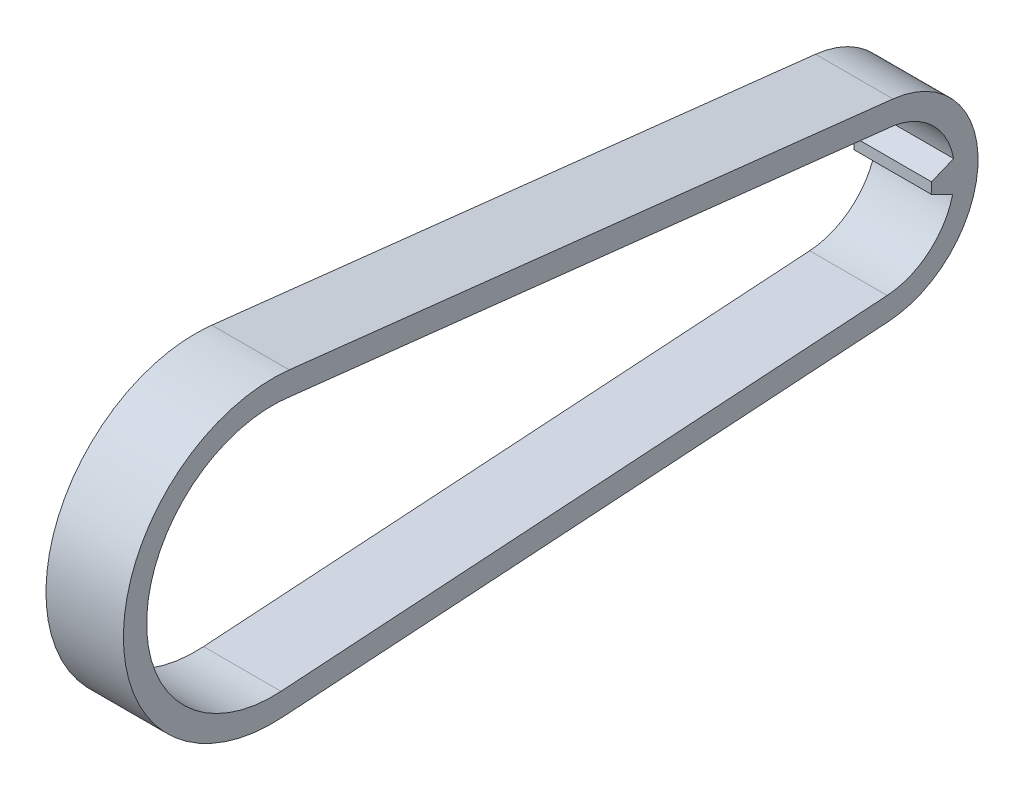
ISO-10303-21;
HEADER;
FILE_DESCRIPTION(('STEP AP214'),'2;1');
FILE_NAME('part.step','',(''),(''),'','','');
FILE_SCHEMA(('AUTOMOTIVE_DESIGN { 1 0 10303 214 1 1 1 1 }'));
ENDSEC;
DATA;
#1=APPLICATION_CONTEXT('core data for automotive mechanical design processes');
#2=APPLICATION_PROTOCOL_DEFINITION('international standard','automotive_design',2000,#1);
#3=PRODUCT_CONTEXT('',#1,'mechanical');
#4=PRODUCT('Part','Part','',(#3));
#5=PRODUCT_RELATED_PRODUCT_CATEGORY('part','',(#4));
#6=PRODUCT_DEFINITION_FORMATION('','',#4);
#7=PRODUCT_DEFINITION_CONTEXT('part definition',#1,'design');
#8=PRODUCT_DEFINITION('design','',#6,#7);
#9=PRODUCT_DEFINITION_SHAPE('','',#8);
#10=(LENGTH_UNIT() NAMED_UNIT(*) SI_UNIT(.MILLI.,.METRE.));
#11=(NAMED_UNIT(*) PLANE_ANGLE_UNIT() SI_UNIT($,.RADIAN.));
#12=(NAMED_UNIT(*) SI_UNIT($,.STERADIAN.) SOLID_ANGLE_UNIT());
#13=UNCERTAINTY_MEASURE_WITH_UNIT(LENGTH_MEASURE(1.E-05),#10,'distance_accuracy_value','');
#14=(GEOMETRIC_REPRESENTATION_CONTEXT(3) GLOBAL_UNCERTAINTY_ASSIGNED_CONTEXT((#13)) GLOBAL_UNIT_ASSIGNED_CONTEXT((#10,
#11,#12)) REPRESENTATION_CONTEXT('',''));
#15=CARTESIAN_POINT('',(0.,0.,0.));
#16=DIRECTION('',(0.,0.,1.));
#17=DIRECTION('',(1.,0.,0.));
#18=AXIS2_PLACEMENT_3D('',#15,#16,#17);
#19=CARTESIAN_POINT('',(10.,0.,0.));
#20=DIRECTION('',(-1.,0.,0.));
#21=DIRECTION('',(0.,0.,1.));
#22=AXIS2_PLACEMENT_3D('',#19,#20,#21);
#23=CYLINDRICAL_SURFACE('',#22,9.34893538375021);
#24=DIRECTION('',(-1.,0.,0.));
#25=VECTOR('',#24,1.);
#26=CARTESIAN_POINT('',(10.,-2.27050491439108,-9.06903524321419));
#27=LINE('',#26,#25);
#28=CARTESIAN_POINT('',(10.,-2.27050491439108,-9.06903524321419));
#29=VERTEX_POINT('',#28);
#30=CARTESIAN_POINT('',(0.,-2.27050491439108,-9.06903524321419));
#31=VERTEX_POINT('',#30);
#32=EDGE_CURVE('E170',#29,#31,#27,.T.);
#33=ORIENTED_EDGE('',*,*,#32,.T.);
#34=CARTESIAN_POINT('',(0.,0.,0.));
#35=DIRECTION('',(1.,0.,0.));
#36=DIRECTION('',(0.,0.,-1.));
#37=AXIS2_PLACEMENT_3D('',#34,#35,#36);
#38=CIRCLE('',#37,9.34893538375021);
#39=CARTESIAN_POINT('',(0.,-9.32893992311466,-0.611124143894561));
#40=VERTEX_POINT('',#39);
#41=EDGE_CURVE('E199',#40,#31,#38,.T.);
#42=ORIENTED_EDGE('',*,*,#41,.F.);
#43=DIRECTION('',(-1.,0.,0.));
#44=VECTOR('',#43,1.);
#45=CARTESIAN_POINT('',(10.,-9.32893992311466,-0.611124143894561));
#46=LINE('',#45,#44);
#47=CARTESIAN_POINT('',(10.,-9.32893992311466,-0.611124143894561));
#48=VERTEX_POINT('',#47);
#49=EDGE_CURVE('E212',#48,#40,#46,.T.);
#50=ORIENTED_EDGE('',*,*,#49,.F.);
#51=CARTESIAN_POINT('',(10.,0.,0.));
#52=DIRECTION('',(1.,0.,0.));
#53=DIRECTION('',(0.,0.,-1.));
#54=AXIS2_PLACEMENT_3D('',#51,#52,#53);
#55=CIRCLE('',#54,9.34893538375021);
#56=EDGE_CURVE('E183',#48,#29,#55,.T.);
#57=ORIENTED_EDGE('',*,*,#56,.T.);
#58=EDGE_LOOP('',(#33,#42,#50,#57));
#59=FACE_BOUND('',#58,.T.);
#60=ADVANCED_FACE('F39',(#59),#23,.F.);
#61=CARTESIAN_POINT('',(10.,0.,0.));
#62=DIRECTION('',(1.,0.,0.));
#63=DIRECTION('',(0.,0.,-1.));
#64=AXIS2_PLACEMENT_3D('',#61,#62,#63);
#65=PLANE('',#64);
#66=CARTESIAN_POINT('',(10.,0.,0.));
#67=DIRECTION('',(1.,0.,0.));
#68=DIRECTION('',(0.,0.,-1.));
#69=AXIS2_PLACEMENT_3D('',#66,#67,#68);
#70=CIRCLE('',#69,12.3489353839288);
#71=CARTESIAN_POINT('',(10.,-12.3225235369909,-0.807229085672322));
#72=VERTEX_POINT('',#71);
#73=CARTESIAN_POINT('',(10.,12.2730966481305,-1.36649324260929));
#74=VERTEX_POINT('',#73);
#75=EDGE_CURVE('E220',#72,#74,#70,.T.);
#76=ORIENTED_EDGE('',*,*,#75,.T.);
#77=DIRECTION('',(0.,0.110656765148166,0.993858682271752));
#78=VECTOR('',#77,1.);
#79=CARTESIAN_POINT('',(10.,20.953089015316,76.5924617713833));
#80=LINE('',#79,#78);
#81=CARTESIAN_POINT('',(10.,20.953089015316,76.5924617713833));
#82=VERTEX_POINT('',#81);
#83=EDGE_CURVE('E224',#74,#82,#80,.T.);
#84=ORIENTED_EDGE('',*,*,#83,.T.);
#85=CARTESIAN_POINT('',(10.,1.79010221894155,78.7260791229133));
#86=DIRECTION('',(1.,0.,0.));
#87=DIRECTION('',(0.,0.,-1.));
#88=AXIS2_PLACEMENT_3D('',#85,#86,#87);
#89=CIRCLE('',#88,19.28140000002);
#90=CARTESIAN_POINT('',(10.,-17.4500588102913,77.4656865134618));
#91=VERTEX_POINT('',#90);
#92=EDGE_CURVE('E228',#82,#91,#89,.T.);
#93=ORIENTED_EDGE('',*,*,#92,.T.);
#94=DIRECTION('',(0.,0.0653683139943276,-0.997861204539759));
#95=VECTOR('',#94,1.);
#96=CARTESIAN_POINT('',(10.,-17.4500588102913,77.4656865134618));
#97=LINE('',#96,#95);
#98=EDGE_CURVE('E231',#91,#72,#97,.T.);
#99=ORIENTED_EDGE('',*,*,#98,.T.);
#100=EDGE_LOOP('',(#76,#84,#93,#99));
#101=FACE_BOUND('',#100,.T.);
#102=DIRECTION('',(0.,0.0653683139972204,-0.99786120453957));
#103=VECTOR('',#102,1.);
#104=CARTESIAN_POINT('',(10.,-14.4564751966547,77.6617914554182));
#105=LINE('',#104,#103);
#106=CARTESIAN_POINT('',(10.,-14.4564751966547,77.6617914554182));
#107=VERTEX_POINT('',#106);
#108=EDGE_CURVE('E179',#107,#48,#105,.T.);
#109=ORIENTED_EDGE('',*,*,#108,.F.);
#110=CARTESIAN_POINT('',(10.,1.79010221894155,78.7260791229133));
#111=DIRECTION('',(1.,0.,0.));
#112=DIRECTION('',(0.,0.,-1.));
#113=AXIS2_PLACEMENT_3D('',#110,#111,#112);
#114=CIRCLE('',#113,16.2813999999979);
#115=CARTESIAN_POINT('',(10.,17.8769256292993,76.2164778550451));
#116=VERTEX_POINT('',#115);
#117=EDGE_CURVE('E176',#116,#107,#114,.T.);
#118=ORIENTED_EDGE('',*,*,#117,.F.);
#119=DIRECTION('',(0.,0.110571917351726,0.993868125604782));
#120=VECTOR('',#119,1.);
#121=CARTESIAN_POINT('',(10.,17.8769256292993,76.2164778550451));
#122=LINE('',#121,#120);
#123=CARTESIAN_POINT('',(10.,9.23720764758625,-1.44103701760436));
#124=VERTEX_POINT('',#123);
#125=EDGE_CURVE('E187',#124,#116,#122,.T.);
#126=ORIENTED_EDGE('',*,*,#125,.F.);
#127=CARTESIAN_POINT('',(10.,1.68716786081824,-9.19543677148384));
#128=VERTEX_POINT('',#127);
#129=EDGE_CURVE('E63',#128,#124,#55,.T.);
#130=ORIENTED_EDGE('',*,*,#129,.F.);
#131=DIRECTION('',(0.,0.378390868507328,-0.925645909962481));
#132=VECTOR('',#131,1.);
#133=CARTESIAN_POINT('',(10.,0.518546586994935,-6.33667459607277));
#134=LINE('',#133,#132);
#135=CARTESIAN_POINT('',(10.,0.518546586994935,-6.33667459607277));
#136=VERTEX_POINT('',#135);
#137=EDGE_CURVE('E133',#136,#128,#134,.T.);
#138=ORIENTED_EDGE('',*,*,#137,.F.);
#139=DIRECTION('',(0.,0.999630970666581,-0.0271647286787288));
#140=VECTOR('',#139,1.);
#141=CARTESIAN_POINT('',(10.,0.518546586994935,-6.33667459607277));
#142=LINE('',#141,#140);
#143=CARTESIAN_POINT('',(10.,-0.861922339698237,-6.29916068849742));
#144=VERTEX_POINT('',#143);
#145=EDGE_CURVE('E146',#144,#136,#142,.T.);
#146=ORIENTED_EDGE('',*,*,#145,.F.);
#147=DIRECTION('',(0.,0.453290600473551,0.891362794558045));
#148=VECTOR('',#147,1.);
#149=CARTESIAN_POINT('',(10.,-0.861922339698237,-6.29916068849742));
#150=LINE('',#149,#148);
#151=EDGE_CURVE('E139',#29,#144,#150,.T.);
#152=ORIENTED_EDGE('',*,*,#151,.F.);
#153=ORIENTED_EDGE('',*,*,#56,.F.);
#154=EDGE_LOOP('',(#109,#118,#126,#130,#138,#146,#152,#153));
#155=FACE_BOUND('',#154,.T.);
#156=ADVANCED_FACE('F144',(#101,#155),#65,.T.);
#157=CARTESIAN_POINT('',(0.,0.,0.));
#158=DIRECTION('',(1.,0.,0.));
#159=DIRECTION('',(0.,0.,-1.));
#160=AXIS2_PLACEMENT_3D('',#157,#158,#159);
#161=PLANE('',#160);
#162=CARTESIAN_POINT('',(0.,0.,0.));
#163=DIRECTION('',(1.,0.,0.));
#164=DIRECTION('',(0.,0.,-1.));
#165=AXIS2_PLACEMENT_3D('',#162,#163,#164);
#166=CIRCLE('',#165,12.3489353839288);
#167=CARTESIAN_POINT('',(0.,-12.3225235369909,-0.807229085672322));
#168=VERTEX_POINT('',#167);
#169=CARTESIAN_POINT('',(0.,12.2730966481305,-1.36649324260929));
#170=VERTEX_POINT('',#169);
#171=EDGE_CURVE('E219',#168,#170,#166,.T.);
#172=ORIENTED_EDGE('',*,*,#171,.F.);
#173=DIRECTION('',(0.,0.0653683139943276,-0.997861204539759));
#174=VECTOR('',#173,1.);
#175=CARTESIAN_POINT('',(0.,-17.4500588102913,77.4656865134618));
#176=LINE('',#175,#174);
#177=CARTESIAN_POINT('',(0.,-17.4500588102913,77.4656865134618));
#178=VERTEX_POINT('',#177);
#179=EDGE_CURVE('E225',#178,#168,#176,.T.);
#180=ORIENTED_EDGE('',*,*,#179,.F.);
#181=CARTESIAN_POINT('',(0.,1.79010221894155,78.7260791229133));
#182=DIRECTION('',(1.,0.,0.));
#183=DIRECTION('',(0.,0.,-1.));
#184=AXIS2_PLACEMENT_3D('',#181,#182,#183);
#185=CIRCLE('',#184,19.28140000002);
#186=CARTESIAN_POINT('',(0.,20.953089015316,76.5924617713833));
#187=VERTEX_POINT('',#186);
#188=EDGE_CURVE('E241',#187,#178,#185,.T.);
#189=ORIENTED_EDGE('',*,*,#188,.F.);
#190=DIRECTION('',(0.,0.110656765148166,0.993858682271752));
#191=VECTOR('',#190,1.);
#192=CARTESIAN_POINT('',(0.,20.953089015316,76.5924617713833));
#193=LINE('',#192,#191);
#194=EDGE_CURVE('E238',#170,#187,#193,.T.);
#195=ORIENTED_EDGE('',*,*,#194,.F.);
#196=EDGE_LOOP('',(#172,#180,#189,#195));
#197=FACE_BOUND('',#196,.T.);
#198=CARTESIAN_POINT('',(0.,1.79010221894155,78.7260791229133));
#199=DIRECTION('',(1.,0.,0.));
#200=DIRECTION('',(0.,0.,-1.));
#201=AXIS2_PLACEMENT_3D('',#198,#199,#200);
#202=CIRCLE('',#201,16.2813999999979);
#203=CARTESIAN_POINT('',(0.,17.8769256292993,76.2164778550451));
#204=VERTEX_POINT('',#203);
#205=CARTESIAN_POINT('',(0.,-14.4564751966547,77.6617914554182));
#206=VERTEX_POINT('',#205);
#207=EDGE_CURVE('E169',#204,#206,#202,.T.);
#208=ORIENTED_EDGE('',*,*,#207,.T.);
#209=DIRECTION('',(0.,0.0653683139972204,-0.99786120453957));
#210=VECTOR('',#209,1.);
#211=CARTESIAN_POINT('',(0.,-14.4564751966547,77.6617914554182));
#212=LINE('',#211,#210);
#213=EDGE_CURVE('E194',#206,#40,#212,.T.);
#214=ORIENTED_EDGE('',*,*,#213,.T.);
#215=ORIENTED_EDGE('',*,*,#41,.T.);
#216=DIRECTION('',(0.,0.453290600473551,0.891362794558045));
#217=VECTOR('',#216,1.);
#218=CARTESIAN_POINT('',(0.,-0.861922339698237,-6.29916068849742));
#219=LINE('',#218,#217);
#220=CARTESIAN_POINT('',(0.,-0.861922339698237,-6.29916068849742));
#221=VERTEX_POINT('',#220);
#222=EDGE_CURVE('E154',#31,#221,#219,.T.);
#223=ORIENTED_EDGE('',*,*,#222,.T.);
#224=DIRECTION('',(0.,0.999630970666581,-0.0271647286787288));
#225=VECTOR('',#224,1.);
#226=CARTESIAN_POINT('',(0.,0.518546586994935,-6.33667459607277));
#227=LINE('',#226,#225);
#228=CARTESIAN_POINT('',(0.,0.518546586994935,-6.33667459607277));
#229=VERTEX_POINT('',#228);
#230=EDGE_CURVE('E162',#221,#229,#227,.T.);
#231=ORIENTED_EDGE('',*,*,#230,.T.);
#232=DIRECTION('',(0.,0.378390868507328,-0.925645909962481));
#233=VECTOR('',#232,1.);
#234=CARTESIAN_POINT('',(0.,0.518546586994935,-6.33667459607277));
#235=LINE('',#234,#233);
#236=CARTESIAN_POINT('',(0.,1.68716786083069,-9.19543677151427));
#237=VERTEX_POINT('',#236);
#238=EDGE_CURVE('E55',#229,#237,#235,.T.);
#239=ORIENTED_EDGE('',*,*,#238,.T.);
#240=CARTESIAN_POINT('',(0.,9.23720764752156,-1.44103701760436));
#241=VERTEX_POINT('',#240);
#242=EDGE_CURVE('E198',#237,#241,#38,.T.);
#243=ORIENTED_EDGE('',*,*,#242,.T.);
#244=DIRECTION('',(0.,0.110571917351726,0.993868125604782));
#245=VECTOR('',#244,1.);
#246=CARTESIAN_POINT('',(0.,17.8769256292993,76.2164778550451));
#247=LINE('',#246,#245);
#248=EDGE_CURVE('E180',#241,#204,#247,.T.);
#249=ORIENTED_EDGE('',*,*,#248,.T.);
#250=EDGE_LOOP('',(#208,#214,#215,#223,#231,#239,#243,#249));
#251=FACE_BOUND('',#250,.T.);
#252=ADVANCED_FACE('F264',(#197,#251),#161,.F.);
#253=CARTESIAN_POINT('',(10.,0.,0.));
#254=DIRECTION('',(-1.,0.,0.));
#255=DIRECTION('',(0.,0.,1.));
#256=AXIS2_PLACEMENT_3D('',#253,#254,#255);
#257=CYLINDRICAL_SURFACE('',#256,12.3489353839288);
#258=ORIENTED_EDGE('',*,*,#171,.T.);
#259=DIRECTION('',(-1.,0.,0.));
#260=VECTOR('',#259,1.);
#261=CARTESIAN_POINT('',(10.,12.2730966481305,-1.36649324260929));
#262=LINE('',#261,#260);
#263=EDGE_CURVE('E11',#74,#170,#262,.T.);
#264=ORIENTED_EDGE('',*,*,#263,.F.);
#265=ORIENTED_EDGE('',*,*,#75,.F.);
#266=DIRECTION('',(-1.,0.,0.));
#267=VECTOR('',#266,1.);
#268=CARTESIAN_POINT('',(10.,-12.3225235369909,-0.807229085672322));
#269=LINE('',#268,#267);
#270=EDGE_CURVE('E234',#72,#168,#269,.T.);
#271=ORIENTED_EDGE('',*,*,#270,.T.);
#272=EDGE_LOOP('',(#258,#264,#265,#271));
#273=FACE_BOUND('',#272,.T.);
#274=ADVANCED_FACE('F41',(#273),#257,.T.);
#275=CARTESIAN_POINT('',(10.,20.953089015316,76.5924617713833));
#276=DIRECTION('',(0.,-0.993858682271752,0.110656765148166));
#277=DIRECTION('',(0.,-0.110656765148166,-0.993858682271752));
#278=AXIS2_PLACEMENT_3D('',#275,#276,#277);
#279=PLANE('',#278);
#280=ORIENTED_EDGE('',*,*,#194,.T.);
#281=DIRECTION('',(-1.,0.,0.));
#282=VECTOR('',#281,1.);
#283=CARTESIAN_POINT('',(10.,20.953089015316,76.5924617713833));
#284=LINE('',#283,#282);
#285=EDGE_CURVE('E48',#82,#187,#284,.T.);
#286=ORIENTED_EDGE('',*,*,#285,.F.);
#287=ORIENTED_EDGE('',*,*,#83,.F.);
#288=ORIENTED_EDGE('',*,*,#263,.T.);
#289=EDGE_LOOP('',(#280,#286,#287,#288));
#290=FACE_BOUND('',#289,.T.);
#291=ADVANCED_FACE('F273',(#290),#279,.F.);
#292=CARTESIAN_POINT('',(10.,1.79010221894155,78.7260791229133));
#293=DIRECTION('',(-1.,0.,0.));
#294=DIRECTION('',(0.,0.,1.));
#295=AXIS2_PLACEMENT_3D('',#292,#293,#294);
#296=CYLINDRICAL_SURFACE('',#295,19.28140000002);
#297=ORIENTED_EDGE('',*,*,#188,.T.);
#298=DIRECTION('',(-1.,0.,0.));
#299=VECTOR('',#298,1.);
#300=CARTESIAN_POINT('',(10.,-17.4500588102913,77.4656865134618));
#301=LINE('',#300,#299);
#302=EDGE_CURVE('E249',#91,#178,#301,.T.);
#303=ORIENTED_EDGE('',*,*,#302,.F.);
#304=ORIENTED_EDGE('',*,*,#92,.F.);
#305=ORIENTED_EDGE('',*,*,#285,.T.);
#306=EDGE_LOOP('',(#297,#303,#304,#305));
#307=FACE_BOUND('',#306,.T.);
#308=ADVANCED_FACE('F258',(#307),#296,.T.);
#309=CARTESIAN_POINT('',(10.,-17.4500588102913,77.4656865134618));
#310=DIRECTION('',(0.,0.997861204539759,0.0653683139943276));
#311=DIRECTION('',(0.,-0.0653683139943276,0.997861204539759));
#312=AXIS2_PLACEMENT_3D('',#309,#310,#311);
#313=PLANE('',#312);
#314=ORIENTED_EDGE('',*,*,#179,.T.);
#315=ORIENTED_EDGE('',*,*,#270,.F.);
#316=ORIENTED_EDGE('',*,*,#98,.F.);
#317=ORIENTED_EDGE('',*,*,#302,.T.);
#318=EDGE_LOOP('',(#314,#315,#316,#317));
#319=FACE_BOUND('',#318,.T.);
#320=ADVANCED_FACE('F267',(#319),#313,.F.);
#321=CARTESIAN_POINT('',(10.,1.79010221894155,78.7260791229133));
#322=DIRECTION('',(-1.,0.,0.));
#323=DIRECTION('',(0.,0.,1.));
#324=AXIS2_PLACEMENT_3D('',#321,#322,#323);
#325=CYLINDRICAL_SURFACE('',#324,16.2813999999979);
#326=ORIENTED_EDGE('',*,*,#207,.F.);
#327=DIRECTION('',(-1.,0.,0.));
#328=VECTOR('',#327,1.);
#329=CARTESIAN_POINT('',(10.,17.8769256292993,76.2164778550451));
#330=LINE('',#329,#328);
#331=EDGE_CURVE('E190',#116,#204,#330,.T.);
#332=ORIENTED_EDGE('',*,*,#331,.F.);
#333=ORIENTED_EDGE('',*,*,#117,.T.);
#334=DIRECTION('',(-1.,0.,0.));
#335=VECTOR('',#334,1.);
#336=CARTESIAN_POINT('',(10.,-14.4564751966547,77.6617914554182));
#337=LINE('',#336,#335);
#338=EDGE_CURVE('E215',#107,#206,#337,.T.);
#339=ORIENTED_EDGE('',*,*,#338,.T.);
#340=EDGE_LOOP('',(#326,#332,#333,#339));
#341=FACE_BOUND('',#340,.T.);
#342=ADVANCED_FACE('F298',(#341),#325,.F.);
#343=CARTESIAN_POINT('',(10.,-14.4564751966547,77.6617914554182));
#344=DIRECTION('',(0.,0.99786120453957,0.0653683139972204));
#345=DIRECTION('',(0.,-0.0653683139972204,0.99786120453957));
#346=AXIS2_PLACEMENT_3D('',#343,#344,#345);
#347=PLANE('',#346);
#348=ORIENTED_EDGE('',*,*,#213,.F.);
#349=ORIENTED_EDGE('',*,*,#338,.F.);
#350=ORIENTED_EDGE('',*,*,#108,.T.);
#351=ORIENTED_EDGE('',*,*,#49,.T.);
#352=EDGE_LOOP('',(#348,#349,#350,#351));
#353=FACE_BOUND('',#352,.T.);
#354=ADVANCED_FACE('F292',(#353),#347,.T.);
#355=DIRECTION('',(-1.,0.,0.));
#356=VECTOR('',#355,1.);
#357=CARTESIAN_POINT('',(10.,1.68716786081824,-9.19543677148384));
#358=LINE('',#357,#356);
#359=EDGE_CURVE('E138',#128,#237,#358,.T.);
#360=ORIENTED_EDGE('',*,*,#359,.F.);
#361=ORIENTED_EDGE('',*,*,#129,.T.);
#362=DIRECTION('',(-1.,0.,0.));
#363=VECTOR('',#362,1.);
#364=CARTESIAN_POINT('',(10.,9.23720764752156,-1.44103701760436));
#365=LINE('',#364,#363);
#366=EDGE_CURVE('E209',#124,#241,#365,.T.);
#367=ORIENTED_EDGE('',*,*,#366,.T.);
#368=ORIENTED_EDGE('',*,*,#242,.F.);
#369=EDGE_LOOP('',(#360,#361,#367,#368));
#370=FACE_BOUND('',#369,.T.);
#371=ADVANCED_FACE('F283',(#370),#23,.F.);
#372=CARTESIAN_POINT('',(10.,17.8769256292993,76.2164778550451));
#373=DIRECTION('',(0.,-0.993868125604782,0.110571917351726));
#374=DIRECTION('',(0.,-0.110571917351726,-0.993868125604782));
#375=AXIS2_PLACEMENT_3D('',#372,#373,#374);
#376=PLANE('',#375);
#377=ORIENTED_EDGE('',*,*,#248,.F.);
#378=ORIENTED_EDGE('',*,*,#366,.F.);
#379=ORIENTED_EDGE('',*,*,#125,.T.);
#380=ORIENTED_EDGE('',*,*,#331,.T.);
#381=EDGE_LOOP('',(#377,#378,#379,#380));
#382=FACE_BOUND('',#381,.T.);
#383=ADVANCED_FACE('F291',(#382),#376,.T.);
#384=CARTESIAN_POINT('',(10.,0.518546586994935,-6.33667459607277));
#385=DIRECTION('',(0.,0.0271647286787288,0.999630970666581));
#386=DIRECTION('',(0.,-0.999630970666581,0.0271647286787288));
#387=AXIS2_PLACEMENT_3D('',#384,#385,#386);
#388=PLANE('',#387);
#389=ORIENTED_EDGE('',*,*,#230,.F.);
#390=DIRECTION('',(-1.,0.,0.));
#391=VECTOR('',#390,1.);
#392=CARTESIAN_POINT('',(10.,-0.861922339698237,-6.29916068849742));
#393=LINE('',#392,#391);
#394=EDGE_CURVE('E152',#144,#221,#393,.T.);
#395=ORIENTED_EDGE('',*,*,#394,.F.);
#396=ORIENTED_EDGE('',*,*,#145,.T.);
#397=DIRECTION('',(-1.,0.,0.));
#398=VECTOR('',#397,1.);
#399=CARTESIAN_POINT('',(10.,0.518546586994935,-6.33667459607277));
#400=LINE('',#399,#398);
#401=EDGE_CURVE('E130',#136,#229,#400,.T.);
#402=ORIENTED_EDGE('',*,*,#401,.T.);
#403=EDGE_LOOP('',(#389,#395,#396,#402));
#404=FACE_BOUND('',#403,.T.);
#405=ADVANCED_FACE('F151',(#404),#388,.T.);
#406=CARTESIAN_POINT('',(10.,-0.861922339698237,-6.29916068849742));
#407=DIRECTION('',(0.,-0.891362794558045,0.453290600473551));
#408=DIRECTION('',(0.,-0.453290600473551,-0.891362794558045));
#409=AXIS2_PLACEMENT_3D('',#406,#407,#408);
#410=PLANE('',#409);
#411=ORIENTED_EDGE('',*,*,#222,.F.);
#412=ORIENTED_EDGE('',*,*,#32,.F.);
#413=ORIENTED_EDGE('',*,*,#151,.T.);
#414=ORIENTED_EDGE('',*,*,#394,.T.);
#415=EDGE_LOOP('',(#411,#412,#413,#414));
#416=FACE_BOUND('',#415,.T.);
#417=ADVANCED_FACE('F312',(#416),#410,.T.);
#418=CARTESIAN_POINT('',(10.,0.518546586994935,-6.33667459607277));
#419=DIRECTION('',(0.,0.925645909962482,0.378390868507328));
#420=DIRECTION('',(0.,-0.378390868507328,0.925645909962482));
#421=AXIS2_PLACEMENT_3D('',#418,#419,#420);
#422=PLANE('',#421);
#423=ORIENTED_EDGE('',*,*,#238,.F.);
#424=ORIENTED_EDGE('',*,*,#401,.F.);
#425=ORIENTED_EDGE('',*,*,#137,.T.);
#426=ORIENTED_EDGE('',*,*,#359,.T.);
#427=EDGE_LOOP('',(#423,#424,#425,#426));
#428=FACE_BOUND('',#427,.T.);
#429=ADVANCED_FACE('F132',(#428),#422,.T.);
#430=CLOSED_SHELL('',(#60,#156,#252,#274,#291,#308,#320,#342,#354,#371,#383,#405,#417,#429));
#431=MANIFOLD_SOLID_BREP('B2',#430);
#432=ADVANCED_BREP_SHAPE_REPRESENTATION('',(#18,#431),#14);
#433=SHAPE_DEFINITION_REPRESENTATION(#9,#432);
ENDSEC;
END-ISO-10303-21;
